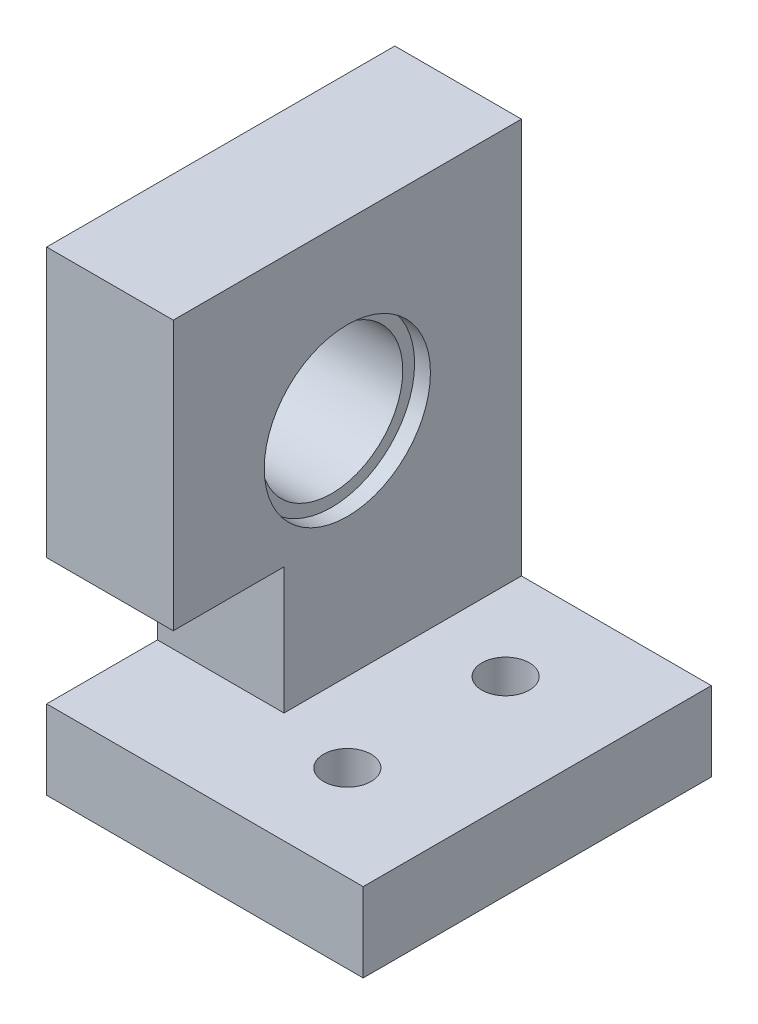
ISO-10303-21;
HEADER;
FILE_DESCRIPTION(('STEP AP214'),'2;1');
FILE_NAME('part.step','',(''),(''),'','','');
FILE_SCHEMA(('AUTOMOTIVE_DESIGN { 1 0 10303 214 1 1 1 1 }'));
ENDSEC;
DATA;
#1=APPLICATION_CONTEXT('core data for automotive mechanical design processes');
#2=APPLICATION_PROTOCOL_DEFINITION('international standard','automotive_design',2000,#1);
#3=PRODUCT_CONTEXT('',#1,'mechanical');
#4=PRODUCT('Part','Part','',(#3));
#5=PRODUCT_RELATED_PRODUCT_CATEGORY('part','',(#4));
#6=PRODUCT_DEFINITION_FORMATION('','',#4);
#7=PRODUCT_DEFINITION_CONTEXT('part definition',#1,'design');
#8=PRODUCT_DEFINITION('design','',#6,#7);
#9=PRODUCT_DEFINITION_SHAPE('','',#8);
#10=(LENGTH_UNIT() NAMED_UNIT(*) SI_UNIT(.MILLI.,.METRE.));
#11=(NAMED_UNIT(*) PLANE_ANGLE_UNIT() SI_UNIT($,.RADIAN.));
#12=(NAMED_UNIT(*) SI_UNIT($,.STERADIAN.) SOLID_ANGLE_UNIT());
#13=UNCERTAINTY_MEASURE_WITH_UNIT(LENGTH_MEASURE(1.E-05),#10,'distance_accuracy_value','');
#14=(GEOMETRIC_REPRESENTATION_CONTEXT(3) GLOBAL_UNCERTAINTY_ASSIGNED_CONTEXT((#13)) GLOBAL_UNIT_ASSIGNED_CONTEXT((#10,
#11,#12)) REPRESENTATION_CONTEXT('',''));
#15=CARTESIAN_POINT('',(0.,0.,0.));
#16=DIRECTION('',(0.,0.,1.));
#17=DIRECTION('',(1.,0.,0.));
#18=AXIS2_PLACEMENT_3D('',#15,#16,#17);
#19=CARTESIAN_POINT('',(8.,0.,0.));
#20=DIRECTION('',(-1.,0.,0.));
#21=DIRECTION('',(0.,0.,1.));
#22=AXIS2_PLACEMENT_3D('',#19,#20,#21);
#23=PLANE('',#22);
#24=CARTESIAN_POINT('',(8.,4.,0.));
#25=DIRECTION('',(1.,0.,0.));
#26=DIRECTION('',(0.,0.,-1.));
#27=AXIS2_PLACEMENT_3D('',#24,#25,#26);
#28=CIRCLE('',#27,5.25);
#29=CARTESIAN_POINT('',(8.,4.,-5.25));
#30=VERTEX_POINT('',#29);
#31=EDGE_CURVE('E347',#30,#30,#28,.T.);
#32=ORIENTED_EDGE('',*,*,#31,.F.);
#33=EDGE_LOOP('',(#32));
#34=FACE_BOUND('',#33,.T.);
#35=DIRECTION('',(0.,0.,1.));
#36=VECTOR('',#35,1.);
#37=CARTESIAN_POINT('',(8.,-10.,11.));
#38=LINE('',#37,#36);
#39=CARTESIAN_POINT('',(8.,-10.,-11.));
#40=VERTEX_POINT('',#39);
#41=CARTESIAN_POINT('',(8.,-10.,4.));
#42=VERTEX_POINT('',#41);
#43=EDGE_CURVE('E310',#40,#42,#38,.T.);
#44=ORIENTED_EDGE('',*,*,#43,.F.);
#45=DIRECTION('',(0.,-1.,0.));
#46=VECTOR('',#45,1.);
#47=CARTESIAN_POINT('',(8.,15.,-11.));
#48=LINE('',#47,#46);
#49=CARTESIAN_POINT('',(8.,15.,-11.));
#50=VERTEX_POINT('',#49);
#51=EDGE_CURVE('E398',#50,#40,#48,.T.);
#52=ORIENTED_EDGE('',*,*,#51,.F.);
#53=DIRECTION('',(0.,0.,-1.));
#54=VECTOR('',#53,1.);
#55=CARTESIAN_POINT('',(8.,15.,11.));
#56=LINE('',#55,#54);
#57=CARTESIAN_POINT('',(8.,15.,11.));
#58=VERTEX_POINT('',#57);
#59=EDGE_CURVE('E402',#58,#50,#56,.T.);
#60=ORIENTED_EDGE('',*,*,#59,.F.);
#61=DIRECTION('',(0.,-1.,0.));
#62=VECTOR('',#61,1.);
#63=CARTESIAN_POINT('',(8.,15.,11.));
#64=LINE('',#63,#62);
#65=CARTESIAN_POINT('',(8.,-2.,11.));
#66=VERTEX_POINT('',#65);
#67=EDGE_CURVE('E407',#58,#66,#64,.T.);
#68=ORIENTED_EDGE('',*,*,#67,.T.);
#69=DIRECTION('',(0.,0.,-1.));
#70=VECTOR('',#69,1.);
#71=CARTESIAN_POINT('',(8.,-2.,11.));
#72=LINE('',#71,#70);
#73=CARTESIAN_POINT('',(8.,-2.,4.));
#74=VERTEX_POINT('',#73);
#75=EDGE_CURVE('E365',#66,#74,#72,.T.);
#76=ORIENTED_EDGE('',*,*,#75,.T.);
#77=DIRECTION('',(0.,-1.,0.));
#78=VECTOR('',#77,1.);
#79=CARTESIAN_POINT('',(8.,-10.,4.));
#80=LINE('',#79,#78);
#81=EDGE_CURVE('E369',#74,#42,#80,.T.);
#82=ORIENTED_EDGE('',*,*,#81,.T.);
#83=EDGE_LOOP('',(#44,#52,#60,#68,#76,#82));
#84=FACE_BOUND('',#83,.T.);
#85=ADVANCED_FACE('F39',(#34,#84),#23,.F.);
#86=CARTESIAN_POINT('',(8.,4.,0.));
#87=DIRECTION('',(-1.,0.,0.));
#88=DIRECTION('',(0.,0.,1.));
#89=AXIS2_PLACEMENT_3D('',#86,#87,#88);
#90=CYLINDRICAL_SURFACE('',#89,4.5);
#91=CARTESIAN_POINT('',(1.,4.,0.));
#92=DIRECTION('',(-1.,0.,0.));
#93=DIRECTION('',(0.,0.,1.));
#94=AXIS2_PLACEMENT_3D('',#91,#92,#93);
#95=CIRCLE('',#94,4.5);
#96=CARTESIAN_POINT('',(1.,4.,4.5));
#97=VERTEX_POINT('',#96);
#98=EDGE_CURVE('E360',#97,#97,#95,.F.);
#99=ORIENTED_EDGE('',*,*,#98,.F.);
#100=EDGE_LOOP('',(#99));
#101=FACE_BOUND('',#100,.T.);
#102=CARTESIAN_POINT('',(7.,4.,0.));
#103=DIRECTION('',(1.,0.,0.));
#104=DIRECTION('',(0.,0.,-1.));
#105=AXIS2_PLACEMENT_3D('',#102,#103,#104);
#106=CIRCLE('',#105,4.5);
#107=CARTESIAN_POINT('',(7.,4.,-4.5));
#108=VERTEX_POINT('',#107);
#109=EDGE_CURVE('E352',#108,#108,#106,.F.);
#110=ORIENTED_EDGE('',*,*,#109,.F.);
#111=EDGE_LOOP('',(#110));
#112=FACE_BOUND('',#111,.T.);
#113=ADVANCED_FACE('F529',(#101,#112),#90,.F.);
#114=CARTESIAN_POINT('',(8.,15.,11.));
#115=DIRECTION('',(0.,0.,-1.));
#116=DIRECTION('',(0.,1.,0.));
#117=AXIS2_PLACEMENT_3D('',#114,#115,#116);
#118=PLANE('',#117);
#119=DIRECTION('',(-1.,0.,0.));
#120=VECTOR('',#119,1.);
#121=CARTESIAN_POINT('',(8.,-15.,11.));
#122=LINE('',#121,#120);
#123=CARTESIAN_POINT('',(20.,-15.,11.));
#124=VERTEX_POINT('',#123);
#125=CARTESIAN_POINT('',(0.,-15.,11.));
#126=VERTEX_POINT('',#125);
#127=EDGE_CURVE('E411',#124,#126,#122,.T.);
#128=ORIENTED_EDGE('',*,*,#127,.F.);
#129=DIRECTION('',(0.,-1.,0.));
#130=VECTOR('',#129,1.);
#131=CARTESIAN_POINT('',(20.,-10.,11.));
#132=LINE('',#131,#130);
#133=CARTESIAN_POINT('',(20.,-10.,11.));
#134=VERTEX_POINT('',#133);
#135=EDGE_CURVE('E325',#134,#124,#132,.T.);
#136=ORIENTED_EDGE('',*,*,#135,.F.);
#137=DIRECTION('',(-1.,0.,0.));
#138=VECTOR('',#137,1.);
#139=CARTESIAN_POINT('',(8.,-10.,11.));
#140=LINE('',#139,#138);
#141=CARTESIAN_POINT('',(0.,-10.,11.));
#142=VERTEX_POINT('',#141);
#143=EDGE_CURVE('E385',#134,#142,#140,.T.);
#144=ORIENTED_EDGE('',*,*,#143,.T.);
#145=DIRECTION('',(0.,-1.,0.));
#146=VECTOR('',#145,1.);
#147=CARTESIAN_POINT('',(0.,15.,11.));
#148=LINE('',#147,#146);
#149=EDGE_CURVE('E423',#142,#126,#148,.T.);
#150=ORIENTED_EDGE('',*,*,#149,.T.);
#151=EDGE_LOOP('',(#128,#136,#144,#150));
#152=FACE_BOUND('',#151,.T.);
#153=ADVANCED_FACE('F490',(#152),#118,.F.);
#154=CARTESIAN_POINT('',(8.,-15.,11.));
#155=DIRECTION('',(0.,1.,0.));
#156=DIRECTION('',(0.,0.,1.));
#157=AXIS2_PLACEMENT_3D('',#154,#155,#156);
#158=PLANE('',#157);
#159=DIRECTION('',(0.5,0.,-0.866025403784439));
#160=VECTOR('',#159,1.);
#161=CARTESIAN_POINT('',(9.8,-15.,5.));
#162=LINE('',#161,#160);
#163=CARTESIAN_POINT('',(9.8,-15.,5.));
#164=VERTEX_POINT('',#163);
#165=CARTESIAN_POINT('',(11.4,-15.,2.2287187078898));
#166=VERTEX_POINT('',#165);
#167=EDGE_CURVE('E231',#164,#166,#162,.T.);
#168=ORIENTED_EDGE('',*,*,#167,.F.);
#169=DIRECTION('',(-0.5,0.,-0.866025403784439));
#170=VECTOR('',#169,1.);
#171=CARTESIAN_POINT('',(11.4,-15.,7.7712812921102));
#172=LINE('',#171,#170);
#173=CARTESIAN_POINT('',(11.4,-15.,7.7712812921102));
#174=VERTEX_POINT('',#173);
#175=EDGE_CURVE('E57',#174,#164,#172,.T.);
#176=ORIENTED_EDGE('',*,*,#175,.F.);
#177=DIRECTION('',(-1.,0.,0.));
#178=VECTOR('',#177,1.);
#179=CARTESIAN_POINT('',(14.6,-15.,7.7712812921102));
#180=LINE('',#179,#178);
#181=CARTESIAN_POINT('',(14.6,-15.,7.7712812921102));
#182=VERTEX_POINT('',#181);
#183=EDGE_CURVE('E208',#182,#174,#180,.T.);
#184=ORIENTED_EDGE('',*,*,#183,.F.);
#185=DIRECTION('',(-0.5,0.,0.866025403784439));
#186=VECTOR('',#185,1.);
#187=CARTESIAN_POINT('',(16.2,-15.,5.));
#188=LINE('',#187,#186);
#189=CARTESIAN_POINT('',(16.2,-15.,5.));
#190=VERTEX_POINT('',#189);
#191=EDGE_CURVE('E212',#190,#182,#188,.T.);
#192=ORIENTED_EDGE('',*,*,#191,.F.);
#193=DIRECTION('',(0.5,0.,0.866025403784438));
#194=VECTOR('',#193,1.);
#195=CARTESIAN_POINT('',(14.6,-15.,2.2287187078898));
#196=LINE('',#195,#194);
#197=CARTESIAN_POINT('',(14.6,-15.,2.2287187078898));
#198=VERTEX_POINT('',#197);
#199=EDGE_CURVE('E239',#198,#190,#196,.T.);
#200=ORIENTED_EDGE('',*,*,#199,.F.);
#201=DIRECTION('',(1.,0.,0.));
#202=VECTOR('',#201,1.);
#203=CARTESIAN_POINT('',(11.4,-15.,2.2287187078898));
#204=LINE('',#203,#202);
#205=EDGE_CURVE('E235',#166,#198,#204,.T.);
#206=ORIENTED_EDGE('',*,*,#205,.F.);
#207=EDGE_LOOP('',(#168,#176,#184,#192,#200,#206));
#208=FACE_BOUND('',#207,.T.);
#209=DIRECTION('',(0.5,0.,-0.866025403784439));
#210=VECTOR('',#209,1.);
#211=CARTESIAN_POINT('',(9.8,-15.,-5.));
#212=LINE('',#211,#210);
#213=CARTESIAN_POINT('',(9.80000000000001,-15.,-5.));
#214=VERTEX_POINT('',#213);
#215=CARTESIAN_POINT('',(11.4,-15.,-7.7712812921102));
#216=VERTEX_POINT('',#215);
#217=EDGE_CURVE('E288',#214,#216,#212,.T.);
#218=ORIENTED_EDGE('',*,*,#217,.F.);
#219=DIRECTION('',(-0.5,0.,-0.866025403784439));
#220=VECTOR('',#219,1.);
#221=CARTESIAN_POINT('',(11.4,-15.,-2.2287187078898));
#222=LINE('',#221,#220);
#223=CARTESIAN_POINT('',(11.4,-15.,-2.2287187078898));
#224=VERTEX_POINT('',#223);
#225=EDGE_CURVE('E65',#224,#214,#222,.T.);
#226=ORIENTED_EDGE('',*,*,#225,.F.);
#227=DIRECTION('',(-1.,0.,0.));
#228=VECTOR('',#227,1.);
#229=CARTESIAN_POINT('',(14.6,-15.,-2.2287187078898));
#230=LINE('',#229,#228);
#231=CARTESIAN_POINT('',(14.6,-15.,-2.2287187078898));
#232=VERTEX_POINT('',#231);
#233=EDGE_CURVE('E265',#232,#224,#230,.T.);
#234=ORIENTED_EDGE('',*,*,#233,.F.);
#235=DIRECTION('',(-0.5,0.,0.866025403784439));
#236=VECTOR('',#235,1.);
#237=CARTESIAN_POINT('',(16.2,-15.,-5.));
#238=LINE('',#237,#236);
#239=CARTESIAN_POINT('',(16.2,-15.,-5.));
#240=VERTEX_POINT('',#239);
#241=EDGE_CURVE('E300',#240,#232,#238,.T.);
#242=ORIENTED_EDGE('',*,*,#241,.F.);
#243=DIRECTION('',(0.5,0.,0.866025403784438));
#244=VECTOR('',#243,1.);
#245=CARTESIAN_POINT('',(14.6,-15.,-7.7712812921102));
#246=LINE('',#245,#244);
#247=CARTESIAN_POINT('',(14.6,-15.,-7.7712812921102));
#248=VERTEX_POINT('',#247);
#249=EDGE_CURVE('E296',#248,#240,#246,.T.);
#250=ORIENTED_EDGE('',*,*,#249,.F.);
#251=DIRECTION('',(1.,0.,0.));
#252=VECTOR('',#251,1.);
#253=CARTESIAN_POINT('',(11.4,-15.,-7.7712812921102));
#254=LINE('',#253,#252);
#255=EDGE_CURVE('E292',#216,#248,#254,.T.);
#256=ORIENTED_EDGE('',*,*,#255,.F.);
#257=EDGE_LOOP('',(#218,#226,#234,#242,#250,#256));
#258=FACE_BOUND('',#257,.T.);
#259=DIRECTION('',(0.,0.,-1.));
#260=VECTOR('',#259,1.);
#261=CARTESIAN_POINT('',(0.,-15.,11.));
#262=LINE('',#261,#260);
#263=CARTESIAN_POINT('',(0.,-15.,-11.));
#264=VERTEX_POINT('',#263);
#265=EDGE_CURVE('E389',#126,#264,#262,.T.);
#266=ORIENTED_EDGE('',*,*,#265,.T.);
#267=DIRECTION('',(-1.,0.,0.));
#268=VECTOR('',#267,1.);
#269=CARTESIAN_POINT('',(8.,-15.,-11.));
#270=LINE('',#269,#268);
#271=CARTESIAN_POINT('',(20.,-15.,-11.));
#272=VERTEX_POINT('',#271);
#273=EDGE_CURVE('E11',#272,#264,#270,.T.);
#274=ORIENTED_EDGE('',*,*,#273,.F.);
#275=DIRECTION('',(0.,0.,-1.));
#276=VECTOR('',#275,1.);
#277=CARTESIAN_POINT('',(20.,-15.,11.));
#278=LINE('',#277,#276);
#279=EDGE_CURVE('E329',#124,#272,#278,.T.);
#280=ORIENTED_EDGE('',*,*,#279,.F.);
#281=ORIENTED_EDGE('',*,*,#127,.T.);
#282=EDGE_LOOP('',(#266,#274,#280,#281));
#283=FACE_BOUND('',#282,.T.);
#284=ADVANCED_FACE('F41',(#208,#258,#283),#158,.F.);
#285=CARTESIAN_POINT('',(8.,15.,-11.));
#286=DIRECTION('',(0.,0.,-1.));
#287=DIRECTION('',(0.,1.,0.));
#288=AXIS2_PLACEMENT_3D('',#285,#286,#287);
#289=PLANE('',#288);
#290=DIRECTION('',(0.,-1.,0.));
#291=VECTOR('',#290,1.);
#292=CARTESIAN_POINT('',(0.,15.,-11.));
#293=LINE('',#292,#291);
#294=CARTESIAN_POINT('',(0.,15.,-11.));
#295=VERTEX_POINT('',#294);
#296=EDGE_CURVE('E415',#295,#264,#293,.T.);
#297=ORIENTED_EDGE('',*,*,#296,.F.);
#298=DIRECTION('',(-1.,0.,0.));
#299=VECTOR('',#298,1.);
#300=CARTESIAN_POINT('',(8.,15.,-11.));
#301=LINE('',#300,#299);
#302=EDGE_CURVE('E49',#50,#295,#301,.T.);
#303=ORIENTED_EDGE('',*,*,#302,.F.);
#304=ORIENTED_EDGE('',*,*,#51,.T.);
#305=DIRECTION('',(-1.,0.,0.));
#306=VECTOR('',#305,1.);
#307=CARTESIAN_POINT('',(20.,-10.,-11.));
#308=LINE('',#307,#306);
#309=CARTESIAN_POINT('',(20.,-10.,-11.));
#310=VERTEX_POINT('',#309);
#311=EDGE_CURVE('E340',#310,#40,#308,.T.);
#312=ORIENTED_EDGE('',*,*,#311,.F.);
#313=DIRECTION('',(0.,1.,0.));
#314=VECTOR('',#313,1.);
#315=CARTESIAN_POINT('',(20.,-10.,-11.));
#316=LINE('',#315,#314);
#317=EDGE_CURVE('E333',#272,#310,#316,.T.);
#318=ORIENTED_EDGE('',*,*,#317,.F.);
#319=ORIENTED_EDGE('',*,*,#273,.T.);
#320=EDGE_LOOP('',(#297,#303,#304,#312,#318,#319));
#321=FACE_BOUND('',#320,.T.);
#322=ADVANCED_FACE('F489',(#321),#289,.T.);
#323=CARTESIAN_POINT('',(8.,15.,11.));
#324=DIRECTION('',(0.,1.,0.));
#325=DIRECTION('',(0.,0.,1.));
#326=AXIS2_PLACEMENT_3D('',#323,#324,#325);
#327=PLANE('',#326);
#328=DIRECTION('',(0.,0.,-1.));
#329=VECTOR('',#328,1.);
#330=CARTESIAN_POINT('',(0.,15.,11.));
#331=LINE('',#330,#329);
#332=CARTESIAN_POINT('',(0.,15.,11.));
#333=VERTEX_POINT('',#332);
#334=EDGE_CURVE('E419',#333,#295,#331,.T.);
#335=ORIENTED_EDGE('',*,*,#334,.F.);
#336=DIRECTION('',(-1.,0.,0.));
#337=VECTOR('',#336,1.);
#338=CARTESIAN_POINT('',(8.,15.,11.));
#339=LINE('',#338,#337);
#340=EDGE_CURVE('E430',#58,#333,#339,.T.);
#341=ORIENTED_EDGE('',*,*,#340,.F.);
#342=ORIENTED_EDGE('',*,*,#59,.T.);
#343=ORIENTED_EDGE('',*,*,#302,.T.);
#344=EDGE_LOOP('',(#335,#341,#342,#343));
#345=FACE_BOUND('',#344,.T.);
#346=ADVANCED_FACE('F526',(#345),#327,.T.);
#347=CARTESIAN_POINT('',(0.,-2.,11.));
#348=VERTEX_POINT('',#347);
#349=EDGE_CURVE('E403',#333,#348,#148,.T.);
#350=ORIENTED_EDGE('',*,*,#349,.T.);
#351=DIRECTION('',(-1.,0.,0.));
#352=VECTOR('',#351,1.);
#353=CARTESIAN_POINT('',(8.,-2.,11.));
#354=LINE('',#353,#352);
#355=EDGE_CURVE('E374',#66,#348,#354,.T.);
#356=ORIENTED_EDGE('',*,*,#355,.F.);
#357=ORIENTED_EDGE('',*,*,#67,.F.);
#358=ORIENTED_EDGE('',*,*,#340,.T.);
#359=EDGE_LOOP('',(#350,#356,#357,#358));
#360=FACE_BOUND('',#359,.T.);
#361=ADVANCED_FACE('F522',(#360),#118,.F.);
#362=CARTESIAN_POINT('',(0.,0.,0.));
#363=DIRECTION('',(-1.,0.,0.));
#364=DIRECTION('',(0.,0.,1.));
#365=AXIS2_PLACEMENT_3D('',#362,#363,#364);
#366=PLANE('',#365);
#367=CARTESIAN_POINT('',(0.,4.,0.));
#368=DIRECTION('',(-1.,0.,0.));
#369=DIRECTION('',(0.,0.,1.));
#370=AXIS2_PLACEMENT_3D('',#367,#368,#369);
#371=CIRCLE('',#370,5.25);
#372=CARTESIAN_POINT('',(0.,4.,5.25));
#373=VERTEX_POINT('',#372);
#374=EDGE_CURVE('E361',#373,#373,#371,.T.);
#375=ORIENTED_EDGE('',*,*,#374,.F.);
#376=EDGE_LOOP('',(#375));
#377=FACE_BOUND('',#376,.T.);
#378=DIRECTION('',(0.,0.,1.));
#379=VECTOR('',#378,1.);
#380=CARTESIAN_POINT('',(0.,-10.,11.));
#381=LINE('',#380,#379);
#382=CARTESIAN_POINT('',(0.,-10.,4.));
#383=VERTEX_POINT('',#382);
#384=EDGE_CURVE('E370',#383,#142,#381,.T.);
#385=ORIENTED_EDGE('',*,*,#384,.F.);
#386=DIRECTION('',(0.,-1.,0.));
#387=VECTOR('',#386,1.);
#388=CARTESIAN_POINT('',(0.,-10.,4.));
#389=LINE('',#388,#387);
#390=CARTESIAN_POINT('',(0.,-2.,4.));
#391=VERTEX_POINT('',#390);
#392=EDGE_CURVE('E379',#391,#383,#389,.T.);
#393=ORIENTED_EDGE('',*,*,#392,.F.);
#394=DIRECTION('',(0.,0.,-1.));
#395=VECTOR('',#394,1.);
#396=CARTESIAN_POINT('',(0.,-2.,11.));
#397=LINE('',#396,#395);
#398=EDGE_CURVE('E375',#348,#391,#397,.T.);
#399=ORIENTED_EDGE('',*,*,#398,.F.);
#400=ORIENTED_EDGE('',*,*,#349,.F.);
#401=ORIENTED_EDGE('',*,*,#334,.T.);
#402=ORIENTED_EDGE('',*,*,#296,.T.);
#403=ORIENTED_EDGE('',*,*,#265,.F.);
#404=ORIENTED_EDGE('',*,*,#149,.F.);
#405=EDGE_LOOP('',(#385,#393,#399,#400,#401,#402,#403,#404));
#406=FACE_BOUND('',#405,.T.);
#407=ADVANCED_FACE('F498',(#377,#406),#366,.T.);
#408=CARTESIAN_POINT('',(8.,-10.,11.));
#409=DIRECTION('',(0.,-1.,0.));
#410=DIRECTION('',(0.,0.,-1.));
#411=AXIS2_PLACEMENT_3D('',#408,#409,#410);
#412=PLANE('',#411);
#413=CARTESIAN_POINT('',(13.,-10.,-5.));
#414=DIRECTION('',(0.,-1.,0.));
#415=DIRECTION('',(0.,0.,-1.));
#416=AXIS2_PLACEMENT_3D('',#413,#414,#415);
#417=CIRCLE('',#416,1.5);
#418=CARTESIAN_POINT('',(13.,-10.,-6.5));
#419=VERTEX_POINT('',#418);
#420=EDGE_CURVE('E43',#419,#419,#417,.T.);
#421=ORIENTED_EDGE('',*,*,#420,.T.);
#422=EDGE_LOOP('',(#421));
#423=FACE_BOUND('',#422,.T.);
#424=CARTESIAN_POINT('',(13.,-10.,5.));
#425=DIRECTION('',(0.,-1.,0.));
#426=DIRECTION('',(0.,0.,-1.));
#427=AXIS2_PLACEMENT_3D('',#424,#425,#426);
#428=CIRCLE('',#427,1.5);
#429=CARTESIAN_POINT('',(13.,-10.,3.5));
#430=VERTEX_POINT('',#429);
#431=EDGE_CURVE('E232',#430,#430,#428,.T.);
#432=ORIENTED_EDGE('',*,*,#431,.T.);
#433=EDGE_LOOP('',(#432));
#434=FACE_BOUND('',#433,.T.);
#435=ORIENTED_EDGE('',*,*,#384,.T.);
#436=ORIENTED_EDGE('',*,*,#143,.F.);
#437=DIRECTION('',(0.,0.,1.));
#438=VECTOR('',#437,1.);
#439=CARTESIAN_POINT('',(20.,-10.,11.));
#440=LINE('',#439,#438);
#441=EDGE_CURVE('E336',#310,#134,#440,.T.);
#442=ORIENTED_EDGE('',*,*,#441,.F.);
#443=ORIENTED_EDGE('',*,*,#311,.T.);
#444=ORIENTED_EDGE('',*,*,#43,.T.);
#445=DIRECTION('',(-1.,0.,0.));
#446=VECTOR('',#445,1.);
#447=CARTESIAN_POINT('',(8.,-10.,4.));
#448=LINE('',#447,#446);
#449=EDGE_CURVE('E390',#42,#383,#448,.T.);
#450=ORIENTED_EDGE('',*,*,#449,.T.);
#451=EDGE_LOOP('',(#435,#436,#442,#443,#444,#450));
#452=FACE_BOUND('',#451,.T.);
#453=ADVANCED_FACE('F514',(#423,#434,#452),#412,.F.);
#454=CARTESIAN_POINT('',(8.,-10.,4.));
#455=DIRECTION('',(0.,0.,-1.));
#456=DIRECTION('',(-1.,0.,0.));
#457=AXIS2_PLACEMENT_3D('',#454,#455,#456);
#458=PLANE('',#457);
#459=ORIENTED_EDGE('',*,*,#392,.T.);
#460=ORIENTED_EDGE('',*,*,#449,.F.);
#461=ORIENTED_EDGE('',*,*,#81,.F.);
#462=DIRECTION('',(-1.,0.,0.));
#463=VECTOR('',#462,1.);
#464=CARTESIAN_POINT('',(8.,-2.,4.));
#465=LINE('',#464,#463);
#466=EDGE_CURVE('E393',#74,#391,#465,.T.);
#467=ORIENTED_EDGE('',*,*,#466,.T.);
#468=EDGE_LOOP('',(#459,#460,#461,#467));
#469=FACE_BOUND('',#468,.T.);
#470=ADVANCED_FACE('F517',(#469),#458,.F.);
#471=CARTESIAN_POINT('',(8.,-2.,11.));
#472=DIRECTION('',(0.,1.,0.));
#473=DIRECTION('',(0.,0.,1.));
#474=AXIS2_PLACEMENT_3D('',#471,#472,#473);
#475=PLANE('',#474);
#476=ORIENTED_EDGE('',*,*,#398,.T.);
#477=ORIENTED_EDGE('',*,*,#466,.F.);
#478=ORIENTED_EDGE('',*,*,#75,.F.);
#479=ORIENTED_EDGE('',*,*,#355,.T.);
#480=EDGE_LOOP('',(#476,#477,#478,#479));
#481=FACE_BOUND('',#480,.T.);
#482=ADVANCED_FACE('F519',(#481),#475,.F.);
#483=CARTESIAN_POINT('',(1.,4.,0.));
#484=DIRECTION('',(-1.,0.,0.));
#485=DIRECTION('',(0.,0.,1.));
#486=AXIS2_PLACEMENT_3D('',#483,#484,#485);
#487=PLANE('',#486);
#488=CARTESIAN_POINT('',(1.,4.,0.));
#489=DIRECTION('',(-1.,0.,0.));
#490=DIRECTION('',(0.,0.,1.));
#491=AXIS2_PLACEMENT_3D('',#488,#489,#490);
#492=CIRCLE('',#491,5.25);
#493=CARTESIAN_POINT('',(1.,4.,5.25));
#494=VERTEX_POINT('',#493);
#495=EDGE_CURVE('E356',#494,#494,#492,.T.);
#496=ORIENTED_EDGE('',*,*,#495,.T.);
#497=EDGE_LOOP('',(#496));
#498=FACE_BOUND('',#497,.T.);
#499=ORIENTED_EDGE('',*,*,#98,.T.);
#500=EDGE_LOOP('',(#499));
#501=FACE_BOUND('',#500,.T.);
#502=ADVANCED_FACE('F587',(#498,#501),#487,.T.);
#503=CARTESIAN_POINT('',(1.,4.,0.));
#504=DIRECTION('',(-1.,0.,0.));
#505=DIRECTION('',(0.,0.,1.));
#506=AXIS2_PLACEMENT_3D('',#503,#504,#505);
#507=CYLINDRICAL_SURFACE('',#506,5.25);
#508=ORIENTED_EDGE('',*,*,#495,.F.);
#509=EDGE_LOOP('',(#508));
#510=FACE_BOUND('',#509,.T.);
#511=ORIENTED_EDGE('',*,*,#374,.T.);
#512=EDGE_LOOP('',(#511));
#513=FACE_BOUND('',#512,.T.);
#514=ADVANCED_FACE('F592',(#510,#513),#507,.F.);
#515=CARTESIAN_POINT('',(7.,4.,0.));
#516=DIRECTION('',(1.,0.,0.));
#517=DIRECTION('',(0.,0.,-1.));
#518=AXIS2_PLACEMENT_3D('',#515,#516,#517);
#519=PLANE('',#518);
#520=CARTESIAN_POINT('',(7.,4.,0.));
#521=DIRECTION('',(1.,0.,0.));
#522=DIRECTION('',(0.,0.,-1.));
#523=AXIS2_PLACEMENT_3D('',#520,#521,#522);
#524=CIRCLE('',#523,5.25);
#525=CARTESIAN_POINT('',(7.,4.,-5.25));
#526=VERTEX_POINT('',#525);
#527=EDGE_CURVE('E348',#526,#526,#524,.T.);
#528=ORIENTED_EDGE('',*,*,#527,.T.);
#529=EDGE_LOOP('',(#528));
#530=FACE_BOUND('',#529,.T.);
#531=ORIENTED_EDGE('',*,*,#109,.T.);
#532=EDGE_LOOP('',(#531));
#533=FACE_BOUND('',#532,.T.);
#534=ADVANCED_FACE('F600',(#530,#533),#519,.T.);
#535=CARTESIAN_POINT('',(7.,4.,0.));
#536=DIRECTION('',(1.,0.,0.));
#537=DIRECTION('',(0.,0.,-1.));
#538=AXIS2_PLACEMENT_3D('',#535,#536,#537);
#539=CYLINDRICAL_SURFACE('',#538,5.25);
#540=ORIENTED_EDGE('',*,*,#527,.F.);
#541=EDGE_LOOP('',(#540));
#542=FACE_BOUND('',#541,.T.);
#543=ORIENTED_EDGE('',*,*,#31,.T.);
#544=EDGE_LOOP('',(#543));
#545=FACE_BOUND('',#544,.T.);
#546=ADVANCED_FACE('F609',(#542,#545),#539,.F.);
#547=CARTESIAN_POINT('',(20.,0.,0.));
#548=DIRECTION('',(1.,0.,0.));
#549=DIRECTION('',(0.,0.,-1.));
#550=AXIS2_PLACEMENT_3D('',#547,#548,#549);
#551=PLANE('',#550);
#552=ORIENTED_EDGE('',*,*,#135,.T.);
#553=ORIENTED_EDGE('',*,*,#279,.T.);
#554=ORIENTED_EDGE('',*,*,#317,.T.);
#555=ORIENTED_EDGE('',*,*,#441,.T.);
#556=EDGE_LOOP('',(#552,#553,#554,#555));
#557=FACE_BOUND('',#556,.T.);
#558=ADVANCED_FACE('F507',(#557),#551,.T.);
#559=CARTESIAN_POINT('',(11.4,-12.5,-2.2287187078898));
#560=DIRECTION('',(-0.866025403784439,0.,0.5));
#561=DIRECTION('',(0.5,0.,0.866025403784439));
#562=AXIS2_PLACEMENT_3D('',#559,#560,#561);
#563=PLANE('',#562);
#564=ORIENTED_EDGE('',*,*,#225,.T.);
#565=DIRECTION('',(0.,-1.,0.));
#566=VECTOR('',#565,1.);
#567=CARTESIAN_POINT('',(9.8,-12.5,-5.));
#568=LINE('',#567,#566);
#569=CARTESIAN_POINT('',(9.8,-12.5,-5.));
#570=VERTEX_POINT('',#569);
#571=EDGE_CURVE('E285',#570,#214,#568,.T.);
#572=ORIENTED_EDGE('',*,*,#571,.F.);
#573=DIRECTION('',(-0.5,0.,-0.866025403784439));
#574=VECTOR('',#573,1.);
#575=CARTESIAN_POINT('',(11.4,-12.5,-2.2287187078898));
#576=LINE('',#575,#574);
#577=CARTESIAN_POINT('',(11.4,-12.5,-2.2287187078898));
#578=VERTEX_POINT('',#577);
#579=EDGE_CURVE('E260',#578,#570,#576,.T.);
#580=ORIENTED_EDGE('',*,*,#579,.F.);
#581=DIRECTION('',(0.,-1.,0.));
#582=VECTOR('',#581,1.);
#583=CARTESIAN_POINT('',(11.4,-12.5,-2.2287187078898));
#584=LINE('',#583,#582);
#585=EDGE_CURVE('E307',#578,#224,#584,.T.);
#586=ORIENTED_EDGE('',*,*,#585,.T.);
#587=EDGE_LOOP('',(#564,#572,#580,#586));
#588=FACE_BOUND('',#587,.T.);
#589=ADVANCED_FACE('F468',(#588),#563,.F.);
#590=CARTESIAN_POINT('',(14.6,-12.5,-2.2287187078898));
#591=DIRECTION('',(0.,0.,1.));
#592=DIRECTION('',(1.,0.,0.));
#593=AXIS2_PLACEMENT_3D('',#590,#591,#592);
#594=PLANE('',#593);
#595=ORIENTED_EDGE('',*,*,#233,.T.);
#596=ORIENTED_EDGE('',*,*,#585,.F.);
#597=DIRECTION('',(-1.,0.,0.));
#598=VECTOR('',#597,1.);
#599=CARTESIAN_POINT('',(14.6,-12.5,-2.2287187078898));
#600=LINE('',#599,#598);
#601=CARTESIAN_POINT('',(14.6,-12.5,-2.2287187078898));
#602=VERTEX_POINT('',#601);
#603=EDGE_CURVE('E281',#602,#578,#600,.T.);
#604=ORIENTED_EDGE('',*,*,#603,.F.);
#605=DIRECTION('',(0.,-1.,0.));
#606=VECTOR('',#605,1.);
#607=CARTESIAN_POINT('',(14.6,-12.5,-2.2287187078898));
#608=LINE('',#607,#606);
#609=EDGE_CURVE('E311',#602,#232,#608,.T.);
#610=ORIENTED_EDGE('',*,*,#609,.T.);
#611=EDGE_LOOP('',(#595,#596,#604,#610));
#612=FACE_BOUND('',#611,.T.);
#613=ADVANCED_FACE('F485',(#612),#594,.F.);
#614=CARTESIAN_POINT('',(16.2,-12.5,-5.));
#615=DIRECTION('',(0.866025403784439,0.,0.5));
#616=DIRECTION('',(0.5,0.,-0.866025403784439));
#617=AXIS2_PLACEMENT_3D('',#614,#615,#616);
#618=PLANE('',#617);
#619=ORIENTED_EDGE('',*,*,#241,.T.);
#620=ORIENTED_EDGE('',*,*,#609,.F.);
#621=DIRECTION('',(-0.5,0.,0.866025403784439));
#622=VECTOR('',#621,1.);
#623=CARTESIAN_POINT('',(16.2,-12.5,-5.));
#624=LINE('',#623,#622);
#625=CARTESIAN_POINT('',(16.2,-12.5,-5.));
#626=VERTEX_POINT('',#625);
#627=EDGE_CURVE('E277',#626,#602,#624,.T.);
#628=ORIENTED_EDGE('',*,*,#627,.F.);
#629=DIRECTION('',(0.,-1.,0.));
#630=VECTOR('',#629,1.);
#631=CARTESIAN_POINT('',(16.2,-12.5,-5.));
#632=LINE('',#631,#630);
#633=EDGE_CURVE('E314',#626,#240,#632,.T.);
#634=ORIENTED_EDGE('',*,*,#633,.T.);
#635=EDGE_LOOP('',(#619,#620,#628,#634));
#636=FACE_BOUND('',#635,.T.);
#637=ADVANCED_FACE('F482',(#636),#618,.F.);
#638=CARTESIAN_POINT('',(14.6,-12.5,-7.7712812921102));
#639=DIRECTION('',(0.866025403784438,0.,-0.5));
#640=DIRECTION('',(-0.5,0.,-0.866025403784438));
#641=AXIS2_PLACEMENT_3D('',#638,#639,#640);
#642=PLANE('',#641);
#643=ORIENTED_EDGE('',*,*,#249,.T.);
#644=ORIENTED_EDGE('',*,*,#633,.F.);
#645=DIRECTION('',(0.5,0.,0.866025403784438));
#646=VECTOR('',#645,1.);
#647=CARTESIAN_POINT('',(14.6,-12.5,-7.7712812921102));
#648=LINE('',#647,#646);
#649=CARTESIAN_POINT('',(14.6,-12.5,-7.7712812921102));
#650=VERTEX_POINT('',#649);
#651=EDGE_CURVE('E273',#650,#626,#648,.T.);
#652=ORIENTED_EDGE('',*,*,#651,.F.);
#653=DIRECTION('',(0.,-1.,0.));
#654=VECTOR('',#653,1.);
#655=CARTESIAN_POINT('',(14.6,-12.5,-7.7712812921102));
#656=LINE('',#655,#654);
#657=EDGE_CURVE('E317',#650,#248,#656,.T.);
#658=ORIENTED_EDGE('',*,*,#657,.T.);
#659=EDGE_LOOP('',(#643,#644,#652,#658));
#660=FACE_BOUND('',#659,.T.);
#661=ADVANCED_FACE('F478',(#660),#642,.F.);
#662=CARTESIAN_POINT('',(11.4,-12.5,-7.7712812921102));
#663=DIRECTION('',(0.,0.,-1.));
#664=DIRECTION('',(-1.,0.,0.));
#665=AXIS2_PLACEMENT_3D('',#662,#663,#664);
#666=PLANE('',#665);
#667=ORIENTED_EDGE('',*,*,#255,.T.);
#668=ORIENTED_EDGE('',*,*,#657,.F.);
#669=DIRECTION('',(1.,0.,0.));
#670=VECTOR('',#669,1.);
#671=CARTESIAN_POINT('',(11.4,-12.5,-7.7712812921102));
#672=LINE('',#671,#670);
#673=CARTESIAN_POINT('',(11.4,-12.5,-7.7712812921102));
#674=VERTEX_POINT('',#673);
#675=EDGE_CURVE('E269',#674,#650,#672,.T.);
#676=ORIENTED_EDGE('',*,*,#675,.F.);
#677=DIRECTION('',(0.,-1.,0.));
#678=VECTOR('',#677,1.);
#679=CARTESIAN_POINT('',(11.4,-12.5,-7.7712812921102));
#680=LINE('',#679,#678);
#681=EDGE_CURVE('E320',#674,#216,#680,.T.);
#682=ORIENTED_EDGE('',*,*,#681,.T.);
#683=EDGE_LOOP('',(#667,#668,#676,#682));
#684=FACE_BOUND('',#683,.T.);
#685=ADVANCED_FACE('F474',(#684),#666,.F.);
#686=CARTESIAN_POINT('',(9.8,-12.5,-5.));
#687=DIRECTION('',(-0.866025403784438,0.,-0.5));
#688=DIRECTION('',(-0.5,0.,0.866025403784439));
#689=AXIS2_PLACEMENT_3D('',#686,#687,#688);
#690=PLANE('',#689);
#691=ORIENTED_EDGE('',*,*,#217,.T.);
#692=ORIENTED_EDGE('',*,*,#681,.F.);
#693=DIRECTION('',(0.5,0.,-0.866025403784439));
#694=VECTOR('',#693,1.);
#695=CARTESIAN_POINT('',(9.8,-12.5,-5.));
#696=LINE('',#695,#694);
#697=EDGE_CURVE('E264',#570,#674,#696,.T.);
#698=ORIENTED_EDGE('',*,*,#697,.F.);
#699=ORIENTED_EDGE('',*,*,#571,.T.);
#700=EDGE_LOOP('',(#691,#692,#698,#699));
#701=FACE_BOUND('',#700,.T.);
#702=ADVANCED_FACE('F463',(#701),#690,.F.);
#703=CARTESIAN_POINT('',(0.,-12.5,0.));
#704=DIRECTION('',(0.,-1.,0.));
#705=DIRECTION('',(0.,0.,-1.));
#706=AXIS2_PLACEMENT_3D('',#703,#704,#705);
#707=PLANE('',#706);
#708=CARTESIAN_POINT('',(13.,-12.5,-5.));
#709=DIRECTION('',(0.,-1.,0.));
#710=DIRECTION('',(0.,0.,-1.));
#711=AXIS2_PLACEMENT_3D('',#708,#709,#710);
#712=CIRCLE('',#711,1.5);
#713=CARTESIAN_POINT('',(13.,-12.5,-6.5));
#714=VERTEX_POINT('',#713);
#715=EDGE_CURVE('E450',#714,#714,#712,.T.);
#716=ORIENTED_EDGE('',*,*,#715,.F.);
#717=EDGE_LOOP('',(#716));
#718=FACE_BOUND('',#717,.T.);
#719=ORIENTED_EDGE('',*,*,#579,.T.);
#720=ORIENTED_EDGE('',*,*,#697,.T.);
#721=ORIENTED_EDGE('',*,*,#675,.T.);
#722=ORIENTED_EDGE('',*,*,#651,.T.);
#723=ORIENTED_EDGE('',*,*,#627,.T.);
#724=ORIENTED_EDGE('',*,*,#603,.T.);
#725=EDGE_LOOP('',(#719,#720,#721,#722,#723,#724));
#726=FACE_BOUND('',#725,.T.);
#727=ADVANCED_FACE('F460',(#718,#726),#707,.T.);
#728=CARTESIAN_POINT('',(11.4,-12.5,7.7712812921102));
#729=DIRECTION('',(-0.866025403784439,0.,0.5));
#730=DIRECTION('',(0.5,0.,0.866025403784439));
#731=AXIS2_PLACEMENT_3D('',#728,#729,#730);
#732=PLANE('',#731);
#733=ORIENTED_EDGE('',*,*,#175,.T.);
#734=DIRECTION('',(0.,-1.,0.));
#735=VECTOR('',#734,1.);
#736=CARTESIAN_POINT('',(9.8,-12.5,5.));
#737=LINE('',#736,#735);
#738=CARTESIAN_POINT('',(9.8,-12.5,5.));
#739=VERTEX_POINT('',#738);
#740=EDGE_CURVE('E182',#739,#164,#737,.T.);
#741=ORIENTED_EDGE('',*,*,#740,.F.);
#742=DIRECTION('',(-0.5,0.,-0.866025403784439));
#743=VECTOR('',#742,1.);
#744=CARTESIAN_POINT('',(11.4,-12.5,7.7712812921102));
#745=LINE('',#744,#743);
#746=CARTESIAN_POINT('',(11.4,-12.5,7.7712812921102));
#747=VERTEX_POINT('',#746);
#748=EDGE_CURVE('E186',#747,#739,#745,.T.);
#749=ORIENTED_EDGE('',*,*,#748,.F.);
#750=DIRECTION('',(0.,-1.,0.));
#751=VECTOR('',#750,1.);
#752=CARTESIAN_POINT('',(11.4,-12.5,7.7712812921102));
#753=LINE('',#752,#751);
#754=EDGE_CURVE('E246',#747,#174,#753,.T.);
#755=ORIENTED_EDGE('',*,*,#754,.T.);
#756=EDGE_LOOP('',(#733,#741,#749,#755));
#757=FACE_BOUND('',#756,.T.);
#758=ADVANCED_FACE('F184',(#757),#732,.F.);
#759=CARTESIAN_POINT('',(14.6,-12.5,7.7712812921102));
#760=DIRECTION('',(0.,0.,1.));
#761=DIRECTION('',(1.,0.,0.));
#762=AXIS2_PLACEMENT_3D('',#759,#760,#761);
#763=PLANE('',#762);
#764=ORIENTED_EDGE('',*,*,#183,.T.);
#765=ORIENTED_EDGE('',*,*,#754,.F.);
#766=DIRECTION('',(-1.,0.,0.));
#767=VECTOR('',#766,1.);
#768=CARTESIAN_POINT('',(14.6,-12.5,7.7712812921102));
#769=LINE('',#768,#767);
#770=CARTESIAN_POINT('',(14.6,-12.5,7.7712812921102));
#771=VERTEX_POINT('',#770);
#772=EDGE_CURVE('E193',#771,#747,#769,.T.);
#773=ORIENTED_EDGE('',*,*,#772,.F.);
#774=DIRECTION('',(0.,-1.,0.));
#775=VECTOR('',#774,1.);
#776=CARTESIAN_POINT('',(14.6,-12.5,7.7712812921102));
#777=LINE('',#776,#775);
#778=EDGE_CURVE('E249',#771,#182,#777,.T.);
#779=ORIENTED_EDGE('',*,*,#778,.T.);
#780=EDGE_LOOP('',(#764,#765,#773,#779));
#781=FACE_BOUND('',#780,.T.);
#782=ADVANCED_FACE('F669',(#781),#763,.F.);
#783=CARTESIAN_POINT('',(16.2,-12.5,5.));
#784=DIRECTION('',(0.866025403784439,0.,0.5));
#785=DIRECTION('',(0.5,0.,-0.866025403784439));
#786=AXIS2_PLACEMENT_3D('',#783,#784,#785);
#787=PLANE('',#786);
#788=ORIENTED_EDGE('',*,*,#191,.T.);
#789=ORIENTED_EDGE('',*,*,#778,.F.);
#790=DIRECTION('',(-0.5,0.,0.866025403784439));
#791=VECTOR('',#790,1.);
#792=CARTESIAN_POINT('',(16.2,-12.5,5.));
#793=LINE('',#792,#791);
#794=CARTESIAN_POINT('',(16.2,-12.5,5.));
#795=VERTEX_POINT('',#794);
#796=EDGE_CURVE('E224',#795,#771,#793,.T.);
#797=ORIENTED_EDGE('',*,*,#796,.F.);
#798=DIRECTION('',(0.,-1.,0.));
#799=VECTOR('',#798,1.);
#800=CARTESIAN_POINT('',(16.2,-12.5,5.));
#801=LINE('',#800,#799);
#802=EDGE_CURVE('E252',#795,#190,#801,.T.);
#803=ORIENTED_EDGE('',*,*,#802,.T.);
#804=EDGE_LOOP('',(#788,#789,#797,#803));
#805=FACE_BOUND('',#804,.T.);
#806=ADVANCED_FACE('F676',(#805),#787,.F.);
#807=CARTESIAN_POINT('',(14.6,-12.5,2.2287187078898));
#808=DIRECTION('',(0.866025403784438,0.,-0.5));
#809=DIRECTION('',(-0.5,0.,-0.866025403784438));
#810=AXIS2_PLACEMENT_3D('',#807,#808,#809);
#811=PLANE('',#810);
#812=ORIENTED_EDGE('',*,*,#199,.T.);
#813=ORIENTED_EDGE('',*,*,#802,.F.);
#814=DIRECTION('',(0.5,0.,0.866025403784438));
#815=VECTOR('',#814,1.);
#816=CARTESIAN_POINT('',(14.6,-12.5,2.2287187078898));
#817=LINE('',#816,#815);
#818=CARTESIAN_POINT('',(14.6,-12.5,2.2287187078898));
#819=VERTEX_POINT('',#818);
#820=EDGE_CURVE('E220',#819,#795,#817,.T.);
#821=ORIENTED_EDGE('',*,*,#820,.F.);
#822=DIRECTION('',(0.,-1.,0.));
#823=VECTOR('',#822,1.);
#824=CARTESIAN_POINT('',(14.6,-12.5,2.2287187078898));
#825=LINE('',#824,#823);
#826=EDGE_CURVE('E255',#819,#198,#825,.T.);
#827=ORIENTED_EDGE('',*,*,#826,.T.);
#828=EDGE_LOOP('',(#812,#813,#821,#827));
#829=FACE_BOUND('',#828,.T.);
#830=ADVANCED_FACE('F684',(#829),#811,.F.);
#831=CARTESIAN_POINT('',(11.4,-12.5,2.2287187078898));
#832=DIRECTION('',(0.,0.,-1.));
#833=DIRECTION('',(-1.,0.,0.));
#834=AXIS2_PLACEMENT_3D('',#831,#832,#833);
#835=PLANE('',#834);
#836=ORIENTED_EDGE('',*,*,#205,.T.);
#837=ORIENTED_EDGE('',*,*,#826,.F.);
#838=DIRECTION('',(1.,0.,0.));
#839=VECTOR('',#838,1.);
#840=CARTESIAN_POINT('',(11.4,-12.5,2.2287187078898));
#841=LINE('',#840,#839);
#842=CARTESIAN_POINT('',(11.4,-12.5,2.2287187078898));
#843=VERTEX_POINT('',#842);
#844=EDGE_CURVE('E202',#843,#819,#841,.T.);
#845=ORIENTED_EDGE('',*,*,#844,.F.);
#846=DIRECTION('',(0.,-1.,0.));
#847=VECTOR('',#846,1.);
#848=CARTESIAN_POINT('',(11.4,-12.5,2.2287187078898));
#849=LINE('',#848,#847);
#850=EDGE_CURVE('E192',#843,#166,#849,.T.);
#851=ORIENTED_EDGE('',*,*,#850,.T.);
#852=EDGE_LOOP('',(#836,#837,#845,#851));
#853=FACE_BOUND('',#852,.T.);
#854=ADVANCED_FACE('F692',(#853),#835,.F.);
#855=CARTESIAN_POINT('',(9.8,-12.5,5.));
#856=DIRECTION('',(-0.866025403784438,0.,-0.5));
#857=DIRECTION('',(-0.5,0.,0.866025403784439));
#858=AXIS2_PLACEMENT_3D('',#855,#856,#857);
#859=PLANE('',#858);
#860=ORIENTED_EDGE('',*,*,#167,.T.);
#861=ORIENTED_EDGE('',*,*,#850,.F.);
#862=DIRECTION('',(0.5,0.,-0.866025403784439));
#863=VECTOR('',#862,1.);
#864=CARTESIAN_POINT('',(9.8,-12.5,5.));
#865=LINE('',#864,#863);
#866=EDGE_CURVE('E196',#739,#843,#865,.T.);
#867=ORIENTED_EDGE('',*,*,#866,.F.);
#868=ORIENTED_EDGE('',*,*,#740,.T.);
#869=EDGE_LOOP('',(#860,#861,#867,#868));
#870=FACE_BOUND('',#869,.T.);
#871=ADVANCED_FACE('F197',(#870),#859,.F.);
#872=CARTESIAN_POINT('',(0.,-12.5,10.));
#873=DIRECTION('',(0.,-1.,0.));
#874=DIRECTION('',(0.,0.,-1.));
#875=AXIS2_PLACEMENT_3D('',#872,#873,#874);
#876=PLANE('',#875);
#877=CARTESIAN_POINT('',(13.,-12.5,5.));
#878=DIRECTION('',(0.,-1.,0.));
#879=DIRECTION('',(0.,0.,-1.));
#880=AXIS2_PLACEMENT_3D('',#877,#878,#879);
#881=CIRCLE('',#880,1.5);
#882=CARTESIAN_POINT('',(13.,-12.5,3.5));
#883=VERTEX_POINT('',#882);
#884=EDGE_CURVE('E215',#883,#883,#881,.T.);
#885=ORIENTED_EDGE('',*,*,#884,.F.);
#886=EDGE_LOOP('',(#885));
#887=FACE_BOUND('',#886,.T.);
#888=ORIENTED_EDGE('',*,*,#748,.T.);
#889=ORIENTED_EDGE('',*,*,#866,.T.);
#890=ORIENTED_EDGE('',*,*,#844,.T.);
#891=ORIENTED_EDGE('',*,*,#820,.T.);
#892=ORIENTED_EDGE('',*,*,#796,.T.);
#893=ORIENTED_EDGE('',*,*,#772,.T.);
#894=EDGE_LOOP('',(#888,#889,#890,#891,#892,#893));
#895=FACE_BOUND('',#894,.T.);
#896=ADVANCED_FACE('F204',(#887,#895),#876,.T.);
#897=CARTESIAN_POINT('',(13.,15.,5.));
#898=DIRECTION('',(0.,-1.,0.));
#899=DIRECTION('',(0.,0.,-1.));
#900=AXIS2_PLACEMENT_3D('',#897,#898,#899);
#901=CYLINDRICAL_SURFACE('',#900,1.5);
#902=ORIENTED_EDGE('',*,*,#884,.T.);
#903=EDGE_LOOP('',(#902));
#904=FACE_BOUND('',#903,.T.);
#905=ORIENTED_EDGE('',*,*,#431,.F.);
#906=EDGE_LOOP('',(#905));
#907=FACE_BOUND('',#906,.T.);
#908=ADVANCED_FACE('F713',(#904,#907),#901,.F.);
#909=CARTESIAN_POINT('',(13.,15.,-5.));
#910=DIRECTION('',(0.,-1.,0.));
#911=DIRECTION('',(0.,0.,-1.));
#912=AXIS2_PLACEMENT_3D('',#909,#910,#911);
#913=CYLINDRICAL_SURFACE('',#912,1.5);
#914=ORIENTED_EDGE('',*,*,#715,.T.);
#915=EDGE_LOOP('',(#914));
#916=FACE_BOUND('',#915,.T.);
#917=ORIENTED_EDGE('',*,*,#420,.F.);
#918=EDGE_LOOP('',(#917));
#919=FACE_BOUND('',#918,.T.);
#920=ADVANCED_FACE('F457',(#916,#919),#913,.F.);
#921=CLOSED_SHELL('',(#85,#113,#153,#284,#322,#346,#361,#407,#453,#470,#482,#502,#514,#534,#546,
#558,#589,#613,#637,#661,#685,#702,#727,#758,#782,#806,#830,#854,#871,#896,#908,#920));
#922=MANIFOLD_SOLID_BREP('B2',#921);
#923=ADVANCED_BREP_SHAPE_REPRESENTATION('',(#18,#922),#14);
#924=SHAPE_DEFINITION_REPRESENTATION(#9,#923);
ENDSEC;
END-ISO-10303-21;
